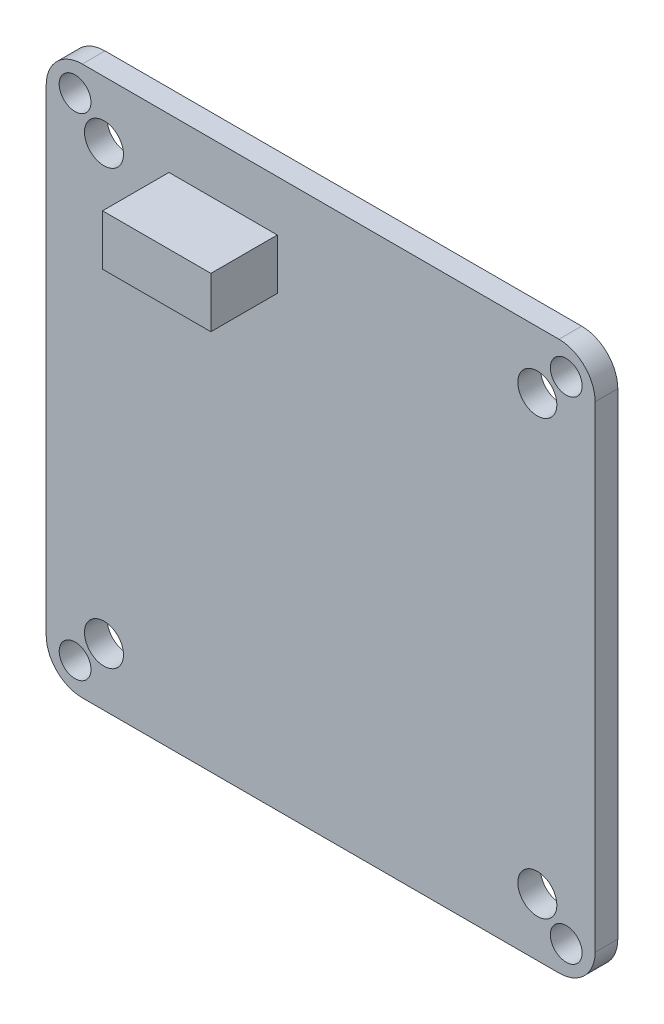
ISO-10303-21;
HEADER;
FILE_DESCRIPTION(('STEP AP214'),'2;1');
FILE_NAME('part.step','',(''),(''),'','','');
FILE_SCHEMA(('AUTOMOTIVE_DESIGN { 1 0 10303 214 1 1 1 1 }'));
ENDSEC;
DATA;
#1=APPLICATION_CONTEXT('core data for automotive mechanical design processes');
#2=APPLICATION_PROTOCOL_DEFINITION('international standard','automotive_design',2000,#1);
#3=PRODUCT_CONTEXT('',#1,'mechanical');
#4=PRODUCT('Part','Part','',(#3));
#5=PRODUCT_RELATED_PRODUCT_CATEGORY('part','',(#4));
#6=PRODUCT_DEFINITION_FORMATION('','',#4);
#7=PRODUCT_DEFINITION_CONTEXT('part definition',#1,'design');
#8=PRODUCT_DEFINITION('design','',#6,#7);
#9=PRODUCT_DEFINITION_SHAPE('','',#8);
#10=(LENGTH_UNIT() NAMED_UNIT(*) SI_UNIT(.MILLI.,.METRE.));
#11=(NAMED_UNIT(*) PLANE_ANGLE_UNIT() SI_UNIT($,.RADIAN.));
#12=(NAMED_UNIT(*) SI_UNIT($,.STERADIAN.) SOLID_ANGLE_UNIT());
#13=UNCERTAINTY_MEASURE_WITH_UNIT(LENGTH_MEASURE(1.E-05),#10,'distance_accuracy_value','');
#14=(GEOMETRIC_REPRESENTATION_CONTEXT(3) GLOBAL_UNCERTAINTY_ASSIGNED_CONTEXT((#13)) GLOBAL_UNIT_ASSIGNED_CONTEXT((#10,
#11,#12)) REPRESENTATION_CONTEXT('',''));
#15=CARTESIAN_POINT('',(0.,0.,0.));
#16=DIRECTION('',(0.,0.,1.));
#17=DIRECTION('',(1.,0.,0.));
#18=AXIS2_PLACEMENT_3D('',#15,#16,#17);
#19=CARTESIAN_POINT('',(-10.5,15.5,6.16999999999993));
#20=DIRECTION('',(1.,0.,0.));
#21=DIRECTION('',(0.,1.,0.));
#22=AXIS2_PLACEMENT_3D('',#19,#20,#21);
#23=PLANE('',#22);
#24=DIRECTION('',(0.,-1.,0.));
#25=VECTOR('',#24,1.);
#26=CARTESIAN_POINT('',(-10.5,15.5,1.56999999999992));
#27=LINE('',#26,#25);
#28=CARTESIAN_POINT('',(-10.5,15.5,1.56999999999992));
#29=VERTEX_POINT('',#28);
#30=CARTESIAN_POINT('',(-10.5,12.,1.57));
#31=VERTEX_POINT('',#30);
#32=EDGE_CURVE('E109',#29,#31,#27,.T.);
#33=ORIENTED_EDGE('',*,*,#32,.T.);
#34=DIRECTION('',(0.,0.,-1.));
#35=VECTOR('',#34,1.);
#36=CARTESIAN_POINT('',(-10.5,12.,6.17000000000001));
#37=LINE('',#36,#35);
#38=CARTESIAN_POINT('',(-10.5,12.,6.17000000000001));
#39=VERTEX_POINT('',#38);
#40=EDGE_CURVE('E12',#39,#31,#37,.T.);
#41=ORIENTED_EDGE('',*,*,#40,.F.);
#42=DIRECTION('',(0.,-1.,0.));
#43=VECTOR('',#42,1.);
#44=CARTESIAN_POINT('',(-10.5,15.5,6.16999999999993));
#45=LINE('',#44,#43);
#46=CARTESIAN_POINT('',(-10.5,15.5,6.16999999999993));
#47=VERTEX_POINT('',#46);
#48=EDGE_CURVE('E97',#47,#39,#45,.T.);
#49=ORIENTED_EDGE('',*,*,#48,.F.);
#50=DIRECTION('',(0.,0.,-1.));
#51=VECTOR('',#50,1.);
#52=CARTESIAN_POINT('',(-10.5,15.5,6.16999999999993));
#53=LINE('',#52,#51);
#54=EDGE_CURVE('E105',#47,#29,#53,.T.);
#55=ORIENTED_EDGE('',*,*,#54,.T.);
#56=EDGE_LOOP('',(#33,#41,#49,#55));
#57=FACE_BOUND('',#56,.T.);
#58=ADVANCED_FACE('F46',(#57),#23,.F.);
#59=CARTESIAN_POINT('',(-10.5,12.,6.17000000000001));
#60=DIRECTION('',(0.,1.,0.));
#61=DIRECTION('',(0.,0.,1.));
#62=AXIS2_PLACEMENT_3D('',#59,#60,#61);
#63=PLANE('',#62);
#64=DIRECTION('',(1.,0.,0.));
#65=VECTOR('',#64,1.);
#66=CARTESIAN_POINT('',(-10.5,12.,1.57));
#67=LINE('',#66,#65);
#68=CARTESIAN_POINT('',(-3.,12.,1.57));
#69=VERTEX_POINT('',#68);
#70=EDGE_CURVE('E101',#31,#69,#67,.T.);
#71=ORIENTED_EDGE('',*,*,#70,.T.);
#72=DIRECTION('',(0.,0.,-1.));
#73=VECTOR('',#72,1.);
#74=CARTESIAN_POINT('',(-3.,12.,6.16999999999999));
#75=LINE('',#74,#73);
#76=CARTESIAN_POINT('',(-3.,12.,6.16999999999999));
#77=VERTEX_POINT('',#76);
#78=EDGE_CURVE('E54',#77,#69,#75,.T.);
#79=ORIENTED_EDGE('',*,*,#78,.F.);
#80=DIRECTION('',(1.,0.,0.));
#81=VECTOR('',#80,1.);
#82=CARTESIAN_POINT('',(-10.5,12.,6.17000000000001));
#83=LINE('',#82,#81);
#84=EDGE_CURVE('E92',#39,#77,#83,.T.);
#85=ORIENTED_EDGE('',*,*,#84,.F.);
#86=ORIENTED_EDGE('',*,*,#40,.T.);
#87=EDGE_LOOP('',(#71,#79,#85,#86));
#88=FACE_BOUND('',#87,.T.);
#89=ADVANCED_FACE('F100',(#88),#63,.F.);
#90=CARTESIAN_POINT('',(-3.,15.5,6.16999999999993));
#91=DIRECTION('',(-1.,0.,0.));
#92=DIRECTION('',(0.,0.,1.));
#93=AXIS2_PLACEMENT_3D('',#90,#91,#92);
#94=PLANE('',#93);
#95=DIRECTION('',(0.,1.,0.));
#96=VECTOR('',#95,1.);
#97=CARTESIAN_POINT('',(-3.,15.5,1.56999999999992));
#98=LINE('',#97,#96);
#99=CARTESIAN_POINT('',(-3.,15.5,1.56999999999992));
#100=VERTEX_POINT('',#99);
#101=EDGE_CURVE('E79',#69,#100,#98,.T.);
#102=ORIENTED_EDGE('',*,*,#101,.T.);
#103=DIRECTION('',(0.,0.,-1.));
#104=VECTOR('',#103,1.);
#105=CARTESIAN_POINT('',(-3.,15.5,6.16999999999993));
#106=LINE('',#105,#104);
#107=CARTESIAN_POINT('',(-3.,15.5,6.16999999999993));
#108=VERTEX_POINT('',#107);
#109=EDGE_CURVE('E102',#108,#100,#106,.T.);
#110=ORIENTED_EDGE('',*,*,#109,.F.);
#111=DIRECTION('',(0.,1.,0.));
#112=VECTOR('',#111,1.);
#113=CARTESIAN_POINT('',(-3.,15.5,6.16999999999993));
#114=LINE('',#113,#112);
#115=EDGE_CURVE('E95',#77,#108,#114,.T.);
#116=ORIENTED_EDGE('',*,*,#115,.F.);
#117=ORIENTED_EDGE('',*,*,#78,.T.);
#118=EDGE_LOOP('',(#102,#110,#116,#117));
#119=FACE_BOUND('',#118,.T.);
#120=ADVANCED_FACE('F103',(#119),#94,.F.);
#121=CARTESIAN_POINT('',(-10.5,15.5,6.16999999999993));
#122=DIRECTION('',(0.,-1.,0.));
#123=DIRECTION('',(0.,0.,-1.));
#124=AXIS2_PLACEMENT_3D('',#121,#122,#123);
#125=PLANE('',#124);
#126=DIRECTION('',(-1.,0.,0.));
#127=VECTOR('',#126,1.);
#128=CARTESIAN_POINT('',(-10.5,15.5,1.56999999999992));
#129=LINE('',#128,#127);
#130=EDGE_CURVE('E85',#100,#29,#129,.T.);
#131=ORIENTED_EDGE('',*,*,#130,.T.);
#132=ORIENTED_EDGE('',*,*,#54,.F.);
#133=DIRECTION('',(-1.,0.,0.));
#134=VECTOR('',#133,1.);
#135=CARTESIAN_POINT('',(-10.5,15.5,6.16999999999993));
#136=LINE('',#135,#134);
#137=EDGE_CURVE('E62',#108,#47,#136,.T.);
#138=ORIENTED_EDGE('',*,*,#137,.F.);
#139=ORIENTED_EDGE('',*,*,#109,.T.);
#140=EDGE_LOOP('',(#131,#132,#138,#139));
#141=FACE_BOUND('',#140,.T.);
#142=ADVANCED_FACE('F116',(#141),#125,.F.);
#143=CARTESIAN_POINT('',(0.,0.,6.16999999999999));
#144=DIRECTION('',(0.,0.,1.));
#145=DIRECTION('',(1.,0.,0.));
#146=AXIS2_PLACEMENT_3D('',#143,#144,#145);
#147=PLANE('',#146);
#148=ORIENTED_EDGE('',*,*,#48,.T.);
#149=ORIENTED_EDGE('',*,*,#84,.T.);
#150=ORIENTED_EDGE('',*,*,#115,.T.);
#151=ORIENTED_EDGE('',*,*,#137,.T.);
#152=EDGE_LOOP('',(#148,#149,#150,#151));
#153=FACE_BOUND('',#152,.T.);
#154=ADVANCED_FACE('F93',(#153),#147,.T.);
#155=CARTESIAN_POINT('',(0.,0.,1.57));
#156=DIRECTION('',(0.,0.,1.));
#157=DIRECTION('',(1.,0.,0.));
#158=AXIS2_PLACEMENT_3D('',#155,#156,#157);
#159=PLANE('',#158);
#160=ORIENTED_EDGE('',*,*,#32,.F.);
#161=ORIENTED_EDGE('',*,*,#130,.F.);
#162=ORIENTED_EDGE('',*,*,#101,.F.);
#163=ORIENTED_EDGE('',*,*,#70,.F.);
#164=EDGE_LOOP('',(#160,#161,#162,#163));
#165=FACE_BOUND('',#164,.T.);
#166=ADVANCED_FACE('F119',(#165),#159,.F.);
#167=CLOSED_SHELL('',(#58,#89,#120,#142,#154,#166));
#168=MANIFOLD_SOLID_BREP('B2',#167);
#169=CARTESIAN_POINT('',(0.,0.,1.57));
#170=DIRECTION('',(0.,0.,-1.));
#171=DIRECTION('',(-1.,0.,0.));
#172=AXIS2_PLACEMENT_3D('',#169,#170,#171);
#173=PLANE('',#172);
#174=CARTESIAN_POINT('',(-15.,15.,1.56999999999999));
#175=DIRECTION('',(0.,0.,1.));
#176=DIRECTION('',(1.,0.,0.));
#177=AXIS2_PLACEMENT_3D('',#174,#175,#176);
#178=CIRCLE('',#177,1.35);
#179=CARTESIAN_POINT('',(-13.65,15.,1.56999999999999));
#180=VERTEX_POINT('',#179);
#181=EDGE_CURVE('E340',#180,#180,#178,.T.);
#182=ORIENTED_EDGE('',*,*,#181,.F.);
#183=EDGE_LOOP('',(#182));
#184=FACE_BOUND('',#183,.T.);
#185=CARTESIAN_POINT('',(15.,-15.,1.56999999999992));
#186=DIRECTION('',(0.,0.,1.));
#187=DIRECTION('',(1.,0.,0.));
#188=AXIS2_PLACEMENT_3D('',#185,#186,#187);
#189=CIRCLE('',#188,1.35);
#190=CARTESIAN_POINT('',(16.35,-15.,1.56999999999992));
#191=VERTEX_POINT('',#190);
#192=EDGE_CURVE('E334',#191,#191,#189,.T.);
#193=ORIENTED_EDGE('',*,*,#192,.F.);
#194=EDGE_LOOP('',(#193));
#195=FACE_BOUND('',#194,.T.);
#196=CARTESIAN_POINT('',(-15.,-15.,1.57));
#197=DIRECTION('',(0.,0.,1.));
#198=DIRECTION('',(1.,0.,0.));
#199=AXIS2_PLACEMENT_3D('',#196,#197,#198);
#200=CIRCLE('',#199,1.35);
#201=CARTESIAN_POINT('',(-13.65,-15.,1.57));
#202=VERTEX_POINT('',#201);
#203=EDGE_CURVE('E328',#202,#202,#200,.T.);
#204=ORIENTED_EDGE('',*,*,#203,.F.);
#205=EDGE_LOOP('',(#204));
#206=FACE_BOUND('',#205,.T.);
#207=CARTESIAN_POINT('',(15.,15.,1.56999999999992));
#208=DIRECTION('',(0.,0.,1.));
#209=DIRECTION('',(1.,0.,0.));
#210=AXIS2_PLACEMENT_3D('',#207,#208,#209);
#211=CIRCLE('',#210,1.35);
#212=CARTESIAN_POINT('',(16.35,15.,1.56999999999992));
#213=VERTEX_POINT('',#212);
#214=EDGE_CURVE('E322',#213,#213,#211,.T.);
#215=ORIENTED_EDGE('',*,*,#214,.F.);
#216=EDGE_LOOP('',(#215));
#217=FACE_BOUND('',#216,.T.);
#218=CARTESIAN_POINT('',(-17.,17.,1.56999999999999));
#219=DIRECTION('',(0.,0.,1.));
#220=DIRECTION('',(1.,0.,0.));
#221=AXIS2_PLACEMENT_3D('',#218,#219,#220);
#222=CIRCLE('',#221,1.1);
#223=CARTESIAN_POINT('',(-15.9,17.,1.56999999999999));
#224=VERTEX_POINT('',#223);
#225=EDGE_CURVE('E316',#224,#224,#222,.T.);
#226=ORIENTED_EDGE('',*,*,#225,.F.);
#227=EDGE_LOOP('',(#226));
#228=FACE_BOUND('',#227,.T.);
#229=CARTESIAN_POINT('',(17.,-17.,1.56999999999992));
#230=DIRECTION('',(0.,0.,1.));
#231=DIRECTION('',(1.,0.,0.));
#232=AXIS2_PLACEMENT_3D('',#229,#230,#231);
#233=CIRCLE('',#232,1.1);
#234=CARTESIAN_POINT('',(18.1,-17.,1.56999999999992));
#235=VERTEX_POINT('',#234);
#236=EDGE_CURVE('E310',#235,#235,#233,.T.);
#237=ORIENTED_EDGE('',*,*,#236,.F.);
#238=EDGE_LOOP('',(#237));
#239=FACE_BOUND('',#238,.T.);
#240=CARTESIAN_POINT('',(-17.,-17.0000000000001,1.57));
#241=DIRECTION('',(0.,0.,1.));
#242=DIRECTION('',(1.,0.,0.));
#243=AXIS2_PLACEMENT_3D('',#240,#241,#242);
#244=CIRCLE('',#243,1.1);
#245=CARTESIAN_POINT('',(-15.9,-17.0000000000001,1.57));
#246=VERTEX_POINT('',#245);
#247=EDGE_CURVE('E304',#246,#246,#244,.T.);
#248=ORIENTED_EDGE('',*,*,#247,.F.);
#249=EDGE_LOOP('',(#248));
#250=FACE_BOUND('',#249,.T.);
#251=DIRECTION('',(0.,-1.,0.));
#252=VECTOR('',#251,1.);
#253=CARTESIAN_POINT('',(-19.,-19.0000000000001,1.57));
#254=LINE('',#253,#252);
#255=CARTESIAN_POINT('',(-19.,16.5,1.57));
#256=VERTEX_POINT('',#255);
#257=CARTESIAN_POINT('',(-19.,-16.5,1.56999999999999));
#258=VERTEX_POINT('',#257);
#259=EDGE_CURVE('E295',#256,#258,#254,.T.);
#260=ORIENTED_EDGE('',*,*,#259,.T.);
#261=CARTESIAN_POINT('',(-16.5,-16.5,1.56999999999999));
#262=DIRECTION('',(0.,0.,-1.));
#263=DIRECTION('',(-1.,0.,0.));
#264=AXIS2_PLACEMENT_3D('',#261,#262,#263);
#265=CIRCLE('',#264,2.5);
#266=CARTESIAN_POINT('',(-16.5,-19.,1.57));
#267=VERTEX_POINT('',#266);
#268=EDGE_CURVE('E272',#258,#267,#265,.F.);
#269=ORIENTED_EDGE('',*,*,#268,.T.);
#270=DIRECTION('',(1.,0.,0.));
#271=VECTOR('',#270,1.);
#272=CARTESIAN_POINT('',(-19.,-19.0000000000001,1.57));
#273=LINE('',#272,#271);
#274=CARTESIAN_POINT('',(16.5,-19.,1.56999999999992));
#275=VERTEX_POINT('',#274);
#276=EDGE_CURVE('E243',#267,#275,#273,.T.);
#277=ORIENTED_EDGE('',*,*,#276,.T.);
#278=CARTESIAN_POINT('',(16.5,-16.5,1.56999999999992));
#279=DIRECTION('',(0.,0.,-1.));
#280=DIRECTION('',(-1.,0.,0.));
#281=AXIS2_PLACEMENT_3D('',#278,#279,#280);
#282=CIRCLE('',#281,2.5);
#283=CARTESIAN_POINT('',(19.,-16.5,1.56999999999992));
#284=VERTEX_POINT('',#283);
#285=EDGE_CURVE('E270',#275,#284,#282,.F.);
#286=ORIENTED_EDGE('',*,*,#285,.T.);
#287=DIRECTION('',(0.,1.,0.));
#288=VECTOR('',#287,1.);
#289=CARTESIAN_POINT('',(19.,-19.,1.56999999999992));
#290=LINE('',#289,#288);
#291=CARTESIAN_POINT('',(19.,16.5,1.56999999999992));
#292=VERTEX_POINT('',#291);
#293=EDGE_CURVE('E250',#284,#292,#290,.T.);
#294=ORIENTED_EDGE('',*,*,#293,.T.);
#295=CARTESIAN_POINT('',(16.5,16.5,1.56999999999992));
#296=DIRECTION('',(0.,0.,-1.));
#297=DIRECTION('',(-1.,0.,0.));
#298=AXIS2_PLACEMENT_3D('',#295,#296,#297);
#299=CIRCLE('',#298,2.5);
#300=CARTESIAN_POINT('',(16.5,19.,1.56999999999992));
#301=VERTEX_POINT('',#300);
#302=EDGE_CURVE('E178',#292,#301,#299,.F.);
#303=ORIENTED_EDGE('',*,*,#302,.T.);
#304=DIRECTION('',(-1.,0.,0.));
#305=VECTOR('',#304,1.);
#306=CARTESIAN_POINT('',(-19.,19.,1.56999999999999));
#307=LINE('',#306,#305);
#308=CARTESIAN_POINT('',(-16.5,19.,1.56999999999999));
#309=VERTEX_POINT('',#308);
#310=EDGE_CURVE('E253',#301,#309,#307,.T.);
#311=ORIENTED_EDGE('',*,*,#310,.T.);
#312=CARTESIAN_POINT('',(-16.5,16.5,1.57));
#313=DIRECTION('',(0.,0.,-1.));
#314=DIRECTION('',(-1.,0.,0.));
#315=AXIS2_PLACEMENT_3D('',#312,#313,#314);
#316=CIRCLE('',#315,2.5);
#317=EDGE_CURVE('E267',#309,#256,#316,.F.);
#318=ORIENTED_EDGE('',*,*,#317,.T.);
#319=EDGE_LOOP('',(#260,#269,#277,#286,#294,#303,#311,#318));
#320=FACE_BOUND('',#319,.T.);
#321=CARTESIAN_POINT('',(17.,17.,1.56999999999992));
#322=DIRECTION('',(0.,0.,1.));
#323=DIRECTION('',(1.,0.,0.));
#324=AXIS2_PLACEMENT_3D('',#321,#322,#323);
#325=CIRCLE('',#324,1.1);
#326=CARTESIAN_POINT('',(18.1,17.,1.56999999999992));
#327=VERTEX_POINT('',#326);
#328=EDGE_CURVE('E291',#327,#327,#325,.T.);
#329=ORIENTED_EDGE('',*,*,#328,.F.);
#330=EDGE_LOOP('',(#329));
#331=FACE_BOUND('',#330,.T.);
#332=ADVANCED_FACE('F157',(#184,#195,#206,#217,#228,#239,#250,#320,#331),#173,.F.);
#333=CARTESIAN_POINT('',(0.,0.,0.));
#334=DIRECTION('',(0.,0.,-1.));
#335=DIRECTION('',(-1.,0.,0.));
#336=AXIS2_PLACEMENT_3D('',#333,#334,#335);
#337=PLANE('',#336);
#338=CARTESIAN_POINT('',(-15.,15.,0.));
#339=DIRECTION('',(0.,0.,1.));
#340=DIRECTION('',(1.,0.,0.));
#341=AXIS2_PLACEMENT_3D('',#338,#339,#340);
#342=CIRCLE('',#341,1.35);
#343=CARTESIAN_POINT('',(-13.65,15.,0.));
#344=VERTEX_POINT('',#343);
#345=EDGE_CURVE('E337',#344,#344,#342,.T.);
#346=ORIENTED_EDGE('',*,*,#345,.T.);
#347=EDGE_LOOP('',(#346));
#348=FACE_BOUND('',#347,.T.);
#349=CARTESIAN_POINT('',(15.,-15.,0.));
#350=DIRECTION('',(0.,0.,1.));
#351=DIRECTION('',(1.,0.,0.));
#352=AXIS2_PLACEMENT_3D('',#349,#350,#351);
#353=CIRCLE('',#352,1.35);
#354=CARTESIAN_POINT('',(16.35,-15.,0.));
#355=VERTEX_POINT('',#354);
#356=EDGE_CURVE('E331',#355,#355,#353,.T.);
#357=ORIENTED_EDGE('',*,*,#356,.T.);
#358=EDGE_LOOP('',(#357));
#359=FACE_BOUND('',#358,.T.);
#360=CARTESIAN_POINT('',(-15.,-15.,0.));
#361=DIRECTION('',(0.,0.,1.));
#362=DIRECTION('',(1.,0.,0.));
#363=AXIS2_PLACEMENT_3D('',#360,#361,#362);
#364=CIRCLE('',#363,1.35);
#365=CARTESIAN_POINT('',(-13.65,-15.,0.));
#366=VERTEX_POINT('',#365);
#367=EDGE_CURVE('E325',#366,#366,#364,.T.);
#368=ORIENTED_EDGE('',*,*,#367,.T.);
#369=EDGE_LOOP('',(#368));
#370=FACE_BOUND('',#369,.T.);
#371=CARTESIAN_POINT('',(15.,15.,0.));
#372=DIRECTION('',(0.,0.,1.));
#373=DIRECTION('',(1.,0.,0.));
#374=AXIS2_PLACEMENT_3D('',#371,#372,#373);
#375=CIRCLE('',#374,1.35);
#376=CARTESIAN_POINT('',(16.35,15.,0.));
#377=VERTEX_POINT('',#376);
#378=EDGE_CURVE('E319',#377,#377,#375,.T.);
#379=ORIENTED_EDGE('',*,*,#378,.T.);
#380=EDGE_LOOP('',(#379));
#381=FACE_BOUND('',#380,.T.);
#382=CARTESIAN_POINT('',(-17.,17.,0.));
#383=DIRECTION('',(0.,0.,1.));
#384=DIRECTION('',(1.,0.,0.));
#385=AXIS2_PLACEMENT_3D('',#382,#383,#384);
#386=CIRCLE('',#385,1.1);
#387=CARTESIAN_POINT('',(-15.9,17.,0.));
#388=VERTEX_POINT('',#387);
#389=EDGE_CURVE('E313',#388,#388,#386,.T.);
#390=ORIENTED_EDGE('',*,*,#389,.T.);
#391=EDGE_LOOP('',(#390));
#392=FACE_BOUND('',#391,.T.);
#393=CARTESIAN_POINT('',(17.,-17.,0.));
#394=DIRECTION('',(0.,0.,1.));
#395=DIRECTION('',(1.,0.,0.));
#396=AXIS2_PLACEMENT_3D('',#393,#394,#395);
#397=CIRCLE('',#396,1.1);
#398=CARTESIAN_POINT('',(18.1,-17.,0.));
#399=VERTEX_POINT('',#398);
#400=EDGE_CURVE('E307',#399,#399,#397,.T.);
#401=ORIENTED_EDGE('',*,*,#400,.T.);
#402=EDGE_LOOP('',(#401));
#403=FACE_BOUND('',#402,.T.);
#404=CARTESIAN_POINT('',(-17.,-17.,0.));
#405=DIRECTION('',(0.,0.,1.));
#406=DIRECTION('',(1.,0.,0.));
#407=AXIS2_PLACEMENT_3D('',#404,#405,#406);
#408=CIRCLE('',#407,1.1);
#409=CARTESIAN_POINT('',(-15.9,-17.,0.));
#410=VERTEX_POINT('',#409);
#411=EDGE_CURVE('E301',#410,#410,#408,.T.);
#412=ORIENTED_EDGE('',*,*,#411,.T.);
#413=EDGE_LOOP('',(#412));
#414=FACE_BOUND('',#413,.T.);
#415=DIRECTION('',(1.,0.,0.));
#416=VECTOR('',#415,1.);
#417=CARTESIAN_POINT('',(-19.,-19.,0.));
#418=LINE('',#417,#416);
#419=CARTESIAN_POINT('',(-16.5,-19.,0.));
#420=VERTEX_POINT('',#419);
#421=CARTESIAN_POINT('',(16.5,-19.,0.));
#422=VERTEX_POINT('',#421);
#423=EDGE_CURVE('E240',#420,#422,#418,.T.);
#424=ORIENTED_EDGE('',*,*,#423,.F.);
#425=CARTESIAN_POINT('',(-16.5,-16.5,0.));
#426=DIRECTION('',(0.,0.,-1.));
#427=DIRECTION('',(-1.,0.,0.));
#428=AXIS2_PLACEMENT_3D('',#425,#426,#427);
#429=CIRCLE('',#428,2.5);
#430=CARTESIAN_POINT('',(-19.,-16.5,0.));
#431=VERTEX_POINT('',#430);
#432=EDGE_CURVE('E223',#420,#431,#429,.T.);
#433=ORIENTED_EDGE('',*,*,#432,.T.);
#434=DIRECTION('',(0.,-1.,0.));
#435=VECTOR('',#434,1.);
#436=CARTESIAN_POINT('',(-19.,-19.,0.));
#437=LINE('',#436,#435);
#438=CARTESIAN_POINT('',(-19.,16.5,0.));
#439=VERTEX_POINT('',#438);
#440=EDGE_CURVE('E251',#439,#431,#437,.T.);
#441=ORIENTED_EDGE('',*,*,#440,.F.);
#442=CARTESIAN_POINT('',(-16.5,16.5,0.));
#443=DIRECTION('',(0.,0.,-1.));
#444=DIRECTION('',(-1.,0.,0.));
#445=AXIS2_PLACEMENT_3D('',#442,#443,#444);
#446=CIRCLE('',#445,2.5);
#447=CARTESIAN_POINT('',(-16.5,19.,0.));
#448=VERTEX_POINT('',#447);
#449=EDGE_CURVE('E244',#439,#448,#446,.T.);
#450=ORIENTED_EDGE('',*,*,#449,.T.);
#451=DIRECTION('',(-1.,0.,0.));
#452=VECTOR('',#451,1.);
#453=CARTESIAN_POINT('',(-19.,19.,0.));
#454=LINE('',#453,#452);
#455=CARTESIAN_POINT('',(16.5,19.,0.));
#456=VERTEX_POINT('',#455);
#457=EDGE_CURVE('E255',#456,#448,#454,.T.);
#458=ORIENTED_EDGE('',*,*,#457,.F.);
#459=CARTESIAN_POINT('',(16.5,16.5,0.));
#460=DIRECTION('',(0.,0.,-1.));
#461=DIRECTION('',(-1.,0.,0.));
#462=AXIS2_PLACEMENT_3D('',#459,#460,#461);
#463=CIRCLE('',#462,2.5);
#464=CARTESIAN_POINT('',(19.,16.5,0.));
#465=VERTEX_POINT('',#464);
#466=EDGE_CURVE('E261',#456,#465,#463,.T.);
#467=ORIENTED_EDGE('',*,*,#466,.T.);
#468=DIRECTION('',(0.,1.,0.));
#469=VECTOR('',#468,1.);
#470=CARTESIAN_POINT('',(19.,-19.,0.));
#471=LINE('',#470,#469);
#472=CARTESIAN_POINT('',(19.,-16.5,0.));
#473=VERTEX_POINT('',#472);
#474=EDGE_CURVE('E283',#473,#465,#471,.T.);
#475=ORIENTED_EDGE('',*,*,#474,.F.);
#476=CARTESIAN_POINT('',(16.5,-16.5,0.));
#477=DIRECTION('',(0.,0.,-1.));
#478=DIRECTION('',(-1.,0.,0.));
#479=AXIS2_PLACEMENT_3D('',#476,#477,#478);
#480=CIRCLE('',#479,2.5);
#481=EDGE_CURVE('E234',#473,#422,#480,.T.);
#482=ORIENTED_EDGE('',*,*,#481,.T.);
#483=EDGE_LOOP('',(#424,#433,#441,#450,#458,#467,#475,#482));
#484=FACE_BOUND('',#483,.T.);
#485=CARTESIAN_POINT('',(17.,17.,0.));
#486=DIRECTION('',(0.,0.,1.));
#487=DIRECTION('',(1.,0.,0.));
#488=AXIS2_PLACEMENT_3D('',#485,#486,#487);
#489=CIRCLE('',#488,1.1);
#490=CARTESIAN_POINT('',(18.1,17.,0.));
#491=VERTEX_POINT('',#490);
#492=EDGE_CURVE('E288',#491,#491,#489,.T.);
#493=ORIENTED_EDGE('',*,*,#492,.T.);
#494=EDGE_LOOP('',(#493));
#495=FACE_BOUND('',#494,.T.);
#496=ADVANCED_FACE('F247',(#348,#359,#370,#381,#392,#403,#414,#484,#495),#337,.T.);
#497=CARTESIAN_POINT('',(19.,-19.,1.56999999999992));
#498=DIRECTION('',(-1.,0.,0.));
#499=DIRECTION('',(0.,0.,1.));
#500=AXIS2_PLACEMENT_3D('',#497,#498,#499);
#501=PLANE('',#500);
#502=ORIENTED_EDGE('',*,*,#293,.F.);
#503=DIRECTION('',(0.,0.,-1.));
#504=VECTOR('',#503,1.);
#505=CARTESIAN_POINT('',(19.,-16.5,1.56999999999992));
#506=LINE('',#505,#504);
#507=EDGE_CURVE('E276',#284,#473,#506,.T.);
#508=ORIENTED_EDGE('',*,*,#507,.T.);
#509=ORIENTED_EDGE('',*,*,#474,.T.);
#510=DIRECTION('',(0.,0.,-1.));
#511=VECTOR('',#510,1.);
#512=CARTESIAN_POINT('',(19.,16.5,1.56999999999992));
#513=LINE('',#512,#511);
#514=EDGE_CURVE('E274',#465,#292,#513,.F.);
#515=ORIENTED_EDGE('',*,*,#514,.T.);
#516=EDGE_LOOP('',(#502,#508,#509,#515));
#517=FACE_BOUND('',#516,.T.);
#518=ADVANCED_FACE('F282',(#517),#501,.F.);
#519=CARTESIAN_POINT('',(-19.,19.,1.56999999999999));
#520=DIRECTION('',(0.,-1.,0.));
#521=DIRECTION('',(0.,0.,-1.));
#522=AXIS2_PLACEMENT_3D('',#519,#520,#521);
#523=PLANE('',#522);
#524=ORIENTED_EDGE('',*,*,#310,.F.);
#525=DIRECTION('',(0.,0.,-1.));
#526=VECTOR('',#525,1.);
#527=CARTESIAN_POINT('',(16.5,19.,1.56999999999992));
#528=LINE('',#527,#526);
#529=EDGE_CURVE('E44',#301,#456,#528,.T.);
#530=ORIENTED_EDGE('',*,*,#529,.T.);
#531=ORIENTED_EDGE('',*,*,#457,.T.);
#532=DIRECTION('',(0.,0.,-1.));
#533=VECTOR('',#532,1.);
#534=CARTESIAN_POINT('',(-16.5,19.,1.56999999999999));
#535=LINE('',#534,#533);
#536=EDGE_CURVE('E165',#448,#309,#535,.F.);
#537=ORIENTED_EDGE('',*,*,#536,.T.);
#538=EDGE_LOOP('',(#524,#530,#531,#537));
#539=FACE_BOUND('',#538,.T.);
#540=ADVANCED_FACE('F389',(#539),#523,.F.);
#541=CARTESIAN_POINT('',(-19.,-19.0000000000001,1.57));
#542=DIRECTION('',(1.,0.,0.));
#543=DIRECTION('',(0.,0.,-1.));
#544=AXIS2_PLACEMENT_3D('',#541,#542,#543);
#545=PLANE('',#544);
#546=ORIENTED_EDGE('',*,*,#440,.T.);
#547=DIRECTION('',(0.,0.,-1.));
#548=VECTOR('',#547,1.);
#549=CARTESIAN_POINT('',(-19.,-16.5,1.56999999999999));
#550=LINE('',#549,#548);
#551=EDGE_CURVE('E228',#431,#258,#550,.F.);
#552=ORIENTED_EDGE('',*,*,#551,.T.);
#553=ORIENTED_EDGE('',*,*,#259,.F.);
#554=DIRECTION('',(0.,0.,-1.));
#555=VECTOR('',#554,1.);
#556=CARTESIAN_POINT('',(-19.,16.5,1.57));
#557=LINE('',#556,#555);
#558=EDGE_CURVE('E233',#256,#439,#557,.T.);
#559=ORIENTED_EDGE('',*,*,#558,.T.);
#560=EDGE_LOOP('',(#546,#552,#553,#559));
#561=FACE_BOUND('',#560,.T.);
#562=ADVANCED_FACE('F386',(#561),#545,.F.);
#563=CARTESIAN_POINT('',(-19.,-19.0000000000001,1.57));
#564=DIRECTION('',(0.,1.,0.));
#565=DIRECTION('',(0.,0.,1.));
#566=AXIS2_PLACEMENT_3D('',#563,#564,#565);
#567=PLANE('',#566);
#568=ORIENTED_EDGE('',*,*,#276,.F.);
#569=DIRECTION('',(0.,0.,-1.));
#570=VECTOR('',#569,1.);
#571=CARTESIAN_POINT('',(-16.5,-19.,1.57));
#572=LINE('',#571,#570);
#573=EDGE_CURVE('E227',#267,#420,#572,.T.);
#574=ORIENTED_EDGE('',*,*,#573,.T.);
#575=ORIENTED_EDGE('',*,*,#423,.T.);
#576=DIRECTION('',(0.,0.,-1.));
#577=VECTOR('',#576,1.);
#578=CARTESIAN_POINT('',(16.5,-19.,1.56999999999992));
#579=LINE('',#578,#577);
#580=EDGE_CURVE('E245',#422,#275,#579,.F.);
#581=ORIENTED_EDGE('',*,*,#580,.T.);
#582=EDGE_LOOP('',(#568,#574,#575,#581));
#583=FACE_BOUND('',#582,.T.);
#584=ADVANCED_FACE('F239',(#583),#567,.F.);
#585=CARTESIAN_POINT('',(-16.5,-16.5,1.56999999999999));
#586=DIRECTION('',(0.,0.,-1.));
#587=DIRECTION('',(-1.,0.,0.));
#588=AXIS2_PLACEMENT_3D('',#585,#586,#587);
#589=CYLINDRICAL_SURFACE('',#588,2.5);
#590=ORIENTED_EDGE('',*,*,#268,.F.);
#591=ORIENTED_EDGE('',*,*,#551,.F.);
#592=ORIENTED_EDGE('',*,*,#432,.F.);
#593=ORIENTED_EDGE('',*,*,#573,.F.);
#594=EDGE_LOOP('',(#590,#591,#592,#593));
#595=FACE_BOUND('',#594,.T.);
#596=ADVANCED_FACE('F226',(#595),#589,.T.);
#597=CARTESIAN_POINT('',(16.5,-16.5,1.56999999999992));
#598=DIRECTION('',(0.,0.,-1.));
#599=DIRECTION('',(-1.,0.,0.));
#600=AXIS2_PLACEMENT_3D('',#597,#598,#599);
#601=CYLINDRICAL_SURFACE('',#600,2.5);
#602=ORIENTED_EDGE('',*,*,#285,.F.);
#603=ORIENTED_EDGE('',*,*,#580,.F.);
#604=ORIENTED_EDGE('',*,*,#481,.F.);
#605=ORIENTED_EDGE('',*,*,#507,.F.);
#606=EDGE_LOOP('',(#602,#603,#604,#605));
#607=FACE_BOUND('',#606,.T.);
#608=ADVANCED_FACE('F397',(#607),#601,.T.);
#609=CARTESIAN_POINT('',(16.5,16.5,1.56999999999992));
#610=DIRECTION('',(0.,0.,-1.));
#611=DIRECTION('',(-1.,0.,0.));
#612=AXIS2_PLACEMENT_3D('',#609,#610,#611);
#613=CYLINDRICAL_SURFACE('',#612,2.5);
#614=ORIENTED_EDGE('',*,*,#302,.F.);
#615=ORIENTED_EDGE('',*,*,#514,.F.);
#616=ORIENTED_EDGE('',*,*,#466,.F.);
#617=ORIENTED_EDGE('',*,*,#529,.F.);
#618=EDGE_LOOP('',(#614,#615,#616,#617));
#619=FACE_BOUND('',#618,.T.);
#620=ADVANCED_FACE('F376',(#619),#613,.T.);
#621=CARTESIAN_POINT('',(-16.5,16.5,1.57));
#622=DIRECTION('',(0.,0.,-1.));
#623=DIRECTION('',(-1.,0.,0.));
#624=AXIS2_PLACEMENT_3D('',#621,#622,#623);
#625=CYLINDRICAL_SURFACE('',#624,2.5);
#626=ORIENTED_EDGE('',*,*,#317,.F.);
#627=ORIENTED_EDGE('',*,*,#536,.F.);
#628=ORIENTED_EDGE('',*,*,#449,.F.);
#629=ORIENTED_EDGE('',*,*,#558,.F.);
#630=EDGE_LOOP('',(#626,#627,#628,#629));
#631=FACE_BOUND('',#630,.T.);
#632=ADVANCED_FACE('F159',(#631),#625,.T.);
#633=CARTESIAN_POINT('',(17.,17.,1.56999999999992));
#634=DIRECTION('',(0.,0.,1.));
#635=DIRECTION('',(1.,0.,0.));
#636=AXIS2_PLACEMENT_3D('',#633,#634,#635);
#637=CYLINDRICAL_SURFACE('',#636,1.1);
#638=ORIENTED_EDGE('',*,*,#492,.F.);
#639=EDGE_LOOP('',(#638));
#640=FACE_BOUND('',#639,.T.);
#641=ORIENTED_EDGE('',*,*,#328,.T.);
#642=EDGE_LOOP('',(#641));
#643=FACE_BOUND('',#642,.T.);
#644=ADVANCED_FACE('F364',(#640,#643),#637,.F.);
#645=CARTESIAN_POINT('',(-17.,-17.0000000000001,1.57));
#646=DIRECTION('',(0.,0.,1.));
#647=DIRECTION('',(1.,0.,0.));
#648=AXIS2_PLACEMENT_3D('',#645,#646,#647);
#649=CYLINDRICAL_SURFACE('',#648,1.1);
#650=ORIENTED_EDGE('',*,*,#411,.F.);
#651=EDGE_LOOP('',(#650));
#652=FACE_BOUND('',#651,.T.);
#653=ORIENTED_EDGE('',*,*,#247,.T.);
#654=EDGE_LOOP('',(#653));
#655=FACE_BOUND('',#654,.T.);
#656=ADVANCED_FACE('F366',(#652,#655),#649,.F.);
#657=CARTESIAN_POINT('',(17.,-17.,1.56999999999992));
#658=DIRECTION('',(0.,0.,1.));
#659=DIRECTION('',(1.,0.,0.));
#660=AXIS2_PLACEMENT_3D('',#657,#658,#659);
#661=CYLINDRICAL_SURFACE('',#660,1.1);
#662=ORIENTED_EDGE('',*,*,#400,.F.);
#663=EDGE_LOOP('',(#662));
#664=FACE_BOUND('',#663,.T.);
#665=ORIENTED_EDGE('',*,*,#236,.T.);
#666=EDGE_LOOP('',(#665));
#667=FACE_BOUND('',#666,.T.);
#668=ADVANCED_FACE('F373',(#664,#667),#661,.F.);
#669=CARTESIAN_POINT('',(-17.,17.,1.56999999999999));
#670=DIRECTION('',(0.,0.,1.));
#671=DIRECTION('',(1.,0.,0.));
#672=AXIS2_PLACEMENT_3D('',#669,#670,#671);
#673=CYLINDRICAL_SURFACE('',#672,1.1);
#674=ORIENTED_EDGE('',*,*,#389,.F.);
#675=EDGE_LOOP('',(#674));
#676=FACE_BOUND('',#675,.T.);
#677=ORIENTED_EDGE('',*,*,#225,.T.);
#678=EDGE_LOOP('',(#677));
#679=FACE_BOUND('',#678,.T.);
#680=ADVANCED_FACE('F433',(#676,#679),#673,.F.);
#681=CARTESIAN_POINT('',(15.,15.,1.56999999999992));
#682=DIRECTION('',(0.,0.,1.));
#683=DIRECTION('',(1.,0.,0.));
#684=AXIS2_PLACEMENT_3D('',#681,#682,#683);
#685=CYLINDRICAL_SURFACE('',#684,1.35);
#686=ORIENTED_EDGE('',*,*,#378,.F.);
#687=EDGE_LOOP('',(#686));
#688=FACE_BOUND('',#687,.T.);
#689=ORIENTED_EDGE('',*,*,#214,.T.);
#690=EDGE_LOOP('',(#689));
#691=FACE_BOUND('',#690,.T.);
#692=ADVANCED_FACE('F440',(#688,#691),#685,.F.);
#693=CARTESIAN_POINT('',(-15.,-15.,1.57));
#694=DIRECTION('',(0.,0.,1.));
#695=DIRECTION('',(1.,0.,0.));
#696=AXIS2_PLACEMENT_3D('',#693,#694,#695);
#697=CYLINDRICAL_SURFACE('',#696,1.35);
#698=ORIENTED_EDGE('',*,*,#367,.F.);
#699=EDGE_LOOP('',(#698));
#700=FACE_BOUND('',#699,.T.);
#701=ORIENTED_EDGE('',*,*,#203,.T.);
#702=EDGE_LOOP('',(#701));
#703=FACE_BOUND('',#702,.T.);
#704=ADVANCED_FACE('F448',(#700,#703),#697,.F.);
#705=CARTESIAN_POINT('',(15.,-15.,1.56999999999992));
#706=DIRECTION('',(0.,0.,1.));
#707=DIRECTION('',(1.,0.,0.));
#708=AXIS2_PLACEMENT_3D('',#705,#706,#707);
#709=CYLINDRICAL_SURFACE('',#708,1.35);
#710=ORIENTED_EDGE('',*,*,#356,.F.);
#711=EDGE_LOOP('',(#710));
#712=FACE_BOUND('',#711,.T.);
#713=ORIENTED_EDGE('',*,*,#192,.T.);
#714=EDGE_LOOP('',(#713));
#715=FACE_BOUND('',#714,.T.);
#716=ADVANCED_FACE('F456',(#712,#715),#709,.F.);
#717=CARTESIAN_POINT('',(-15.,15.,1.56999999999999));
#718=DIRECTION('',(0.,0.,1.));
#719=DIRECTION('',(1.,0.,0.));
#720=AXIS2_PLACEMENT_3D('',#717,#718,#719);
#721=CYLINDRICAL_SURFACE('',#720,1.35);
#722=ORIENTED_EDGE('',*,*,#345,.F.);
#723=EDGE_LOOP('',(#722));
#724=FACE_BOUND('',#723,.T.);
#725=ORIENTED_EDGE('',*,*,#181,.T.);
#726=EDGE_LOOP('',(#725));
#727=FACE_BOUND('',#726,.T.);
#728=ADVANCED_FACE('F344',(#724,#727),#721,.F.);
#729=CLOSED_SHELL('',(#332,#496,#518,#540,#562,#584,#596,#608,#620,#632,#644,#656,#668,#680,
#692,#704,#716,#728));
#730=MANIFOLD_SOLID_BREP('B6',#729);
#731=ADVANCED_BREP_SHAPE_REPRESENTATION('',(#18,#168,#730),#14);
#732=SHAPE_DEFINITION_REPRESENTATION(#9,#731);
ENDSEC;
END-ISO-10303-21;
